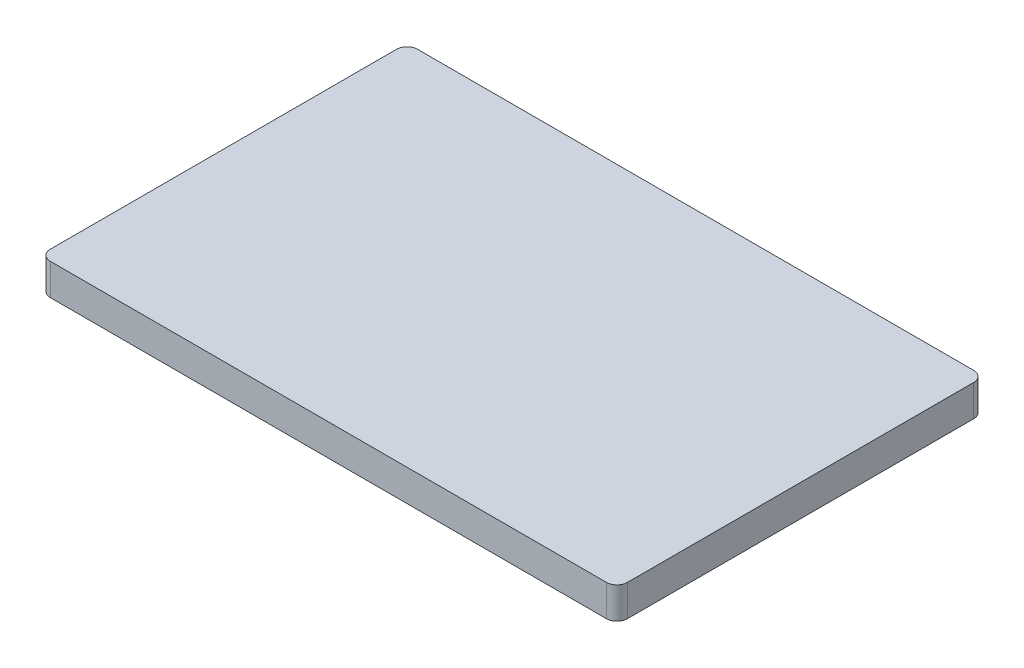
ISO-10303-21;
HEADER;
FILE_DESCRIPTION(('STEP AP214'),'2;1');
FILE_NAME('part.step','',(''),(''),'','','');
FILE_SCHEMA(('AUTOMOTIVE_DESIGN { 1 0 10303 214 1 1 1 1 }'));
ENDSEC;
DATA;
#1=APPLICATION_CONTEXT('core data for automotive mechanical design processes');
#2=APPLICATION_PROTOCOL_DEFINITION('international standard','automotive_design',2000,#1);
#3=PRODUCT_CONTEXT('',#1,'mechanical');
#4=PRODUCT('Part','Part','',(#3));
#5=PRODUCT_RELATED_PRODUCT_CATEGORY('part','',(#4));
#6=PRODUCT_DEFINITION_FORMATION('','',#4);
#7=PRODUCT_DEFINITION_CONTEXT('part definition',#1,'design');
#8=PRODUCT_DEFINITION('design','',#6,#7);
#9=PRODUCT_DEFINITION_SHAPE('','',#8);
#10=(LENGTH_UNIT() NAMED_UNIT(*) SI_UNIT(.MILLI.,.METRE.));
#11=(NAMED_UNIT(*) PLANE_ANGLE_UNIT() SI_UNIT($,.RADIAN.));
#12=(NAMED_UNIT(*) SI_UNIT($,.STERADIAN.) SOLID_ANGLE_UNIT());
#13=UNCERTAINTY_MEASURE_WITH_UNIT(LENGTH_MEASURE(1.E-05),#10,'distance_accuracy_value','');
#14=(GEOMETRIC_REPRESENTATION_CONTEXT(3) GLOBAL_UNCERTAINTY_ASSIGNED_CONTEXT((#13)) GLOBAL_UNIT_ASSIGNED_CONTEXT((#10,
#11,#12)) REPRESENTATION_CONTEXT('',''));
#15=CARTESIAN_POINT('',(0.,0.,0.));
#16=DIRECTION('',(0.,0.,1.));
#17=DIRECTION('',(1.,0.,0.));
#18=AXIS2_PLACEMENT_3D('',#15,#16,#17);
#19=CARTESIAN_POINT('',(26.5,3.,16.5));
#20=DIRECTION('',(0.,-1.,0.));
#21=DIRECTION('',(0.,0.,-1.));
#22=AXIS2_PLACEMENT_3D('',#19,#20,#21);
#23=CYLINDRICAL_SURFACE('',#22,1.);
#24=CARTESIAN_POINT('',(26.5,0.,16.5));
#25=DIRECTION('',(0.,1.,0.));
#26=DIRECTION('',(0.,0.,1.));
#27=AXIS2_PLACEMENT_3D('',#24,#25,#26);
#28=CIRCLE('',#27,1.);
#29=CARTESIAN_POINT('',(26.5,0.,17.5));
#30=VERTEX_POINT('',#29);
#31=CARTESIAN_POINT('',(27.5,0.,16.5));
#32=VERTEX_POINT('',#31);
#33=EDGE_CURVE('E130',#30,#32,#28,.T.);
#34=ORIENTED_EDGE('',*,*,#33,.T.);
#35=DIRECTION('',(0.,-1.,0.));
#36=VECTOR('',#35,1.);
#37=CARTESIAN_POINT('',(27.5,3.,16.5));
#38=LINE('',#37,#36);
#39=CARTESIAN_POINT('',(27.5,3.,16.5));
#40=VERTEX_POINT('',#39);
#41=EDGE_CURVE('E11',#40,#32,#38,.T.);
#42=ORIENTED_EDGE('',*,*,#41,.F.);
#43=CARTESIAN_POINT('',(26.5,3.,16.5));
#44=DIRECTION('',(0.,1.,0.));
#45=DIRECTION('',(0.,0.,1.));
#46=AXIS2_PLACEMENT_3D('',#43,#44,#45);
#47=CIRCLE('',#46,1.);
#48=CARTESIAN_POINT('',(26.5,3.,17.5));
#49=VERTEX_POINT('',#48);
#50=EDGE_CURVE('E144',#49,#40,#47,.T.);
#51=ORIENTED_EDGE('',*,*,#50,.F.);
#52=DIRECTION('',(0.,-1.,0.));
#53=VECTOR('',#52,1.);
#54=CARTESIAN_POINT('',(26.5,3.,17.5));
#55=LINE('',#54,#53);
#56=EDGE_CURVE('E126',#49,#30,#55,.T.);
#57=ORIENTED_EDGE('',*,*,#56,.T.);
#58=EDGE_LOOP('',(#34,#42,#51,#57));
#59=FACE_BOUND('',#58,.T.);
#60=ADVANCED_FACE('F34',(#59),#23,.T.);
#61=CARTESIAN_POINT('',(27.5,3.,16.5));
#62=DIRECTION('',(-1.,0.,0.));
#63=DIRECTION('',(0.,0.,1.));
#64=AXIS2_PLACEMENT_3D('',#61,#62,#63);
#65=PLANE('',#64);
#66=DIRECTION('',(0.,0.,-1.));
#67=VECTOR('',#66,1.);
#68=CARTESIAN_POINT('',(27.5,0.,16.5));
#69=LINE('',#68,#67);
#70=CARTESIAN_POINT('',(27.5,0.,-16.5));
#71=VERTEX_POINT('',#70);
#72=EDGE_CURVE('E133',#32,#71,#69,.T.);
#73=ORIENTED_EDGE('',*,*,#72,.T.);
#74=DIRECTION('',(0.,-1.,0.));
#75=VECTOR('',#74,1.);
#76=CARTESIAN_POINT('',(27.5,3.,-16.5));
#77=LINE('',#76,#75);
#78=CARTESIAN_POINT('',(27.5,3.,-16.5));
#79=VERTEX_POINT('',#78);
#80=EDGE_CURVE('E42',#79,#71,#77,.T.);
#81=ORIENTED_EDGE('',*,*,#80,.F.);
#82=DIRECTION('',(0.,0.,-1.));
#83=VECTOR('',#82,1.);
#84=CARTESIAN_POINT('',(27.5,3.,16.5));
#85=LINE('',#84,#83);
#86=EDGE_CURVE('E93',#40,#79,#85,.T.);
#87=ORIENTED_EDGE('',*,*,#86,.F.);
#88=ORIENTED_EDGE('',*,*,#41,.T.);
#89=EDGE_LOOP('',(#73,#81,#87,#88));
#90=FACE_BOUND('',#89,.T.);
#91=ADVANCED_FACE('F179',(#90),#65,.F.);
#92=CARTESIAN_POINT('',(26.5,3.,-16.5));
#93=DIRECTION('',(0.,-1.,0.));
#94=DIRECTION('',(0.,0.,-1.));
#95=AXIS2_PLACEMENT_3D('',#92,#93,#94);
#96=CYLINDRICAL_SURFACE('',#95,1.);
#97=CARTESIAN_POINT('',(26.5,0.,-16.5));
#98=DIRECTION('',(0.,1.,0.));
#99=DIRECTION('',(0.,0.,1.));
#100=AXIS2_PLACEMENT_3D('',#97,#98,#99);
#101=CIRCLE('',#100,1.);
#102=CARTESIAN_POINT('',(26.5,0.,-17.5));
#103=VERTEX_POINT('',#102);
#104=EDGE_CURVE('E135',#71,#103,#101,.T.);
#105=ORIENTED_EDGE('',*,*,#104,.T.);
#106=DIRECTION('',(0.,-1.,0.));
#107=VECTOR('',#106,1.);
#108=CARTESIAN_POINT('',(26.5,3.,-17.5));
#109=LINE('',#108,#107);
#110=CARTESIAN_POINT('',(26.5,3.,-17.5));
#111=VERTEX_POINT('',#110);
#112=EDGE_CURVE('E151',#111,#103,#109,.T.);
#113=ORIENTED_EDGE('',*,*,#112,.F.);
#114=CARTESIAN_POINT('',(26.5,3.,-16.5));
#115=DIRECTION('',(0.,1.,0.));
#116=DIRECTION('',(0.,0.,1.));
#117=AXIS2_PLACEMENT_3D('',#114,#115,#116);
#118=CIRCLE('',#117,1.);
#119=EDGE_CURVE('E159',#79,#111,#118,.T.);
#120=ORIENTED_EDGE('',*,*,#119,.F.);
#121=ORIENTED_EDGE('',*,*,#80,.T.);
#122=EDGE_LOOP('',(#105,#113,#120,#121));
#123=FACE_BOUND('',#122,.T.);
#124=ADVANCED_FACE('F157',(#123),#96,.T.);
#125=CARTESIAN_POINT('',(26.5,3.,-17.5));
#126=DIRECTION('',(0.,0.,1.));
#127=DIRECTION('',(1.,0.,0.));
#128=AXIS2_PLACEMENT_3D('',#125,#126,#127);
#129=PLANE('',#128);
#130=DIRECTION('',(-1.,0.,0.));
#131=VECTOR('',#130,1.);
#132=CARTESIAN_POINT('',(26.5,0.,-17.5));
#133=LINE('',#132,#131);
#134=CARTESIAN_POINT('',(-26.5,0.,-17.5));
#135=VERTEX_POINT('',#134);
#136=EDGE_CURVE('E137',#103,#135,#133,.T.);
#137=ORIENTED_EDGE('',*,*,#136,.T.);
#138=DIRECTION('',(0.,-1.,0.));
#139=VECTOR('',#138,1.);
#140=CARTESIAN_POINT('',(-26.5,3.,-17.5));
#141=LINE('',#140,#139);
#142=CARTESIAN_POINT('',(-26.5,3.,-17.5));
#143=VERTEX_POINT('',#142);
#144=EDGE_CURVE('E148',#143,#135,#141,.T.);
#145=ORIENTED_EDGE('',*,*,#144,.F.);
#146=DIRECTION('',(-1.,0.,0.));
#147=VECTOR('',#146,1.);
#148=CARTESIAN_POINT('',(26.5,3.,-17.5));
#149=LINE('',#148,#147);
#150=EDGE_CURVE('E171',#111,#143,#149,.T.);
#151=ORIENTED_EDGE('',*,*,#150,.F.);
#152=ORIENTED_EDGE('',*,*,#112,.T.);
#153=EDGE_LOOP('',(#137,#145,#151,#152));
#154=FACE_BOUND('',#153,.T.);
#155=ADVANCED_FACE('F167',(#154),#129,.F.);
#156=CARTESIAN_POINT('',(-26.5,3.,-16.5));
#157=DIRECTION('',(0.,-1.,0.));
#158=DIRECTION('',(0.,0.,-1.));
#159=AXIS2_PLACEMENT_3D('',#156,#157,#158);
#160=CYLINDRICAL_SURFACE('',#159,1.);
#161=CARTESIAN_POINT('',(-26.5,0.,-16.5));
#162=DIRECTION('',(0.,1.,0.));
#163=DIRECTION('',(0.,0.,1.));
#164=AXIS2_PLACEMENT_3D('',#161,#162,#163);
#165=CIRCLE('',#164,1.);
#166=CARTESIAN_POINT('',(-27.5,0.,-16.5));
#167=VERTEX_POINT('',#166);
#168=EDGE_CURVE('E139',#135,#167,#165,.T.);
#169=ORIENTED_EDGE('',*,*,#168,.T.);
#170=DIRECTION('',(0.,-1.,0.));
#171=VECTOR('',#170,1.);
#172=CARTESIAN_POINT('',(-27.5,3.,-16.5));
#173=LINE('',#172,#171);
#174=CARTESIAN_POINT('',(-27.5,3.,-16.5));
#175=VERTEX_POINT('',#174);
#176=EDGE_CURVE('E121',#175,#167,#173,.T.);
#177=ORIENTED_EDGE('',*,*,#176,.F.);
#178=CARTESIAN_POINT('',(-26.5,3.,-16.5));
#179=DIRECTION('',(0.,1.,0.));
#180=DIRECTION('',(0.,0.,1.));
#181=AXIS2_PLACEMENT_3D('',#178,#179,#180);
#182=CIRCLE('',#181,1.);
#183=EDGE_CURVE('E112',#143,#175,#182,.T.);
#184=ORIENTED_EDGE('',*,*,#183,.F.);
#185=ORIENTED_EDGE('',*,*,#144,.T.);
#186=EDGE_LOOP('',(#169,#177,#184,#185));
#187=FACE_BOUND('',#186,.T.);
#188=ADVANCED_FACE('F170',(#187),#160,.T.);
#189=CARTESIAN_POINT('',(-27.5,3.,16.5));
#190=DIRECTION('',(1.,0.,0.));
#191=DIRECTION('',(0.,0.,-1.));
#192=AXIS2_PLACEMENT_3D('',#189,#190,#191);
#193=PLANE('',#192);
#194=DIRECTION('',(0.,0.,1.));
#195=VECTOR('',#194,1.);
#196=CARTESIAN_POINT('',(-27.5,0.,16.5));
#197=LINE('',#196,#195);
#198=CARTESIAN_POINT('',(-27.5,0.,16.5));
#199=VERTEX_POINT('',#198);
#200=EDGE_CURVE('E120',#167,#199,#197,.T.);
#201=ORIENTED_EDGE('',*,*,#200,.T.);
#202=DIRECTION('',(0.,-1.,0.));
#203=VECTOR('',#202,1.);
#204=CARTESIAN_POINT('',(-27.5,3.,16.5));
#205=LINE('',#204,#203);
#206=CARTESIAN_POINT('',(-27.5,3.,16.5));
#207=VERTEX_POINT('',#206);
#208=EDGE_CURVE('E117',#207,#199,#205,.T.);
#209=ORIENTED_EDGE('',*,*,#208,.F.);
#210=DIRECTION('',(0.,0.,1.));
#211=VECTOR('',#210,1.);
#212=CARTESIAN_POINT('',(-27.5,3.,16.5));
#213=LINE('',#212,#211);
#214=EDGE_CURVE('E106',#175,#207,#213,.T.);
#215=ORIENTED_EDGE('',*,*,#214,.F.);
#216=ORIENTED_EDGE('',*,*,#176,.T.);
#217=EDGE_LOOP('',(#201,#209,#215,#216));
#218=FACE_BOUND('',#217,.T.);
#219=ADVANCED_FACE('F118',(#218),#193,.F.);
#220=CARTESIAN_POINT('',(-26.5,3.,16.5));
#221=DIRECTION('',(0.,-1.,0.));
#222=DIRECTION('',(0.,0.,-1.));
#223=AXIS2_PLACEMENT_3D('',#220,#221,#222);
#224=CYLINDRICAL_SURFACE('',#223,1.);
#225=CARTESIAN_POINT('',(-26.5,0.,16.5));
#226=DIRECTION('',(0.,1.,0.));
#227=DIRECTION('',(0.,0.,-1.));
#228=AXIS2_PLACEMENT_3D('',#225,#226,#227);
#229=CIRCLE('',#228,1.);
#230=CARTESIAN_POINT('',(-26.5,0.,17.5));
#231=VERTEX_POINT('',#230);
#232=EDGE_CURVE('E79',#199,#231,#229,.T.);
#233=ORIENTED_EDGE('',*,*,#232,.T.);
#234=DIRECTION('',(0.,-1.,0.));
#235=VECTOR('',#234,1.);
#236=CARTESIAN_POINT('',(-26.5,3.,17.5));
#237=LINE('',#236,#235);
#238=CARTESIAN_POINT('',(-26.5,3.,17.5));
#239=VERTEX_POINT('',#238);
#240=EDGE_CURVE('E122',#239,#231,#237,.T.);
#241=ORIENTED_EDGE('',*,*,#240,.F.);
#242=CARTESIAN_POINT('',(-26.5,3.,16.5));
#243=DIRECTION('',(0.,1.,0.));
#244=DIRECTION('',(0.,0.,-1.));
#245=AXIS2_PLACEMENT_3D('',#242,#243,#244);
#246=CIRCLE('',#245,1.);
#247=EDGE_CURVE('E110',#207,#239,#246,.T.);
#248=ORIENTED_EDGE('',*,*,#247,.F.);
#249=ORIENTED_EDGE('',*,*,#208,.T.);
#250=EDGE_LOOP('',(#233,#241,#248,#249));
#251=FACE_BOUND('',#250,.T.);
#252=ADVANCED_FACE('F124',(#251),#224,.T.);
#253=CARTESIAN_POINT('',(26.5,3.,17.5));
#254=DIRECTION('',(0.,0.,-1.));
#255=DIRECTION('',(-1.,0.,0.));
#256=AXIS2_PLACEMENT_3D('',#253,#254,#255);
#257=PLANE('',#256);
#258=DIRECTION('',(1.,0.,0.));
#259=VECTOR('',#258,1.);
#260=CARTESIAN_POINT('',(26.5,0.,17.5));
#261=LINE('',#260,#259);
#262=EDGE_CURVE('E85',#231,#30,#261,.T.);
#263=ORIENTED_EDGE('',*,*,#262,.T.);
#264=ORIENTED_EDGE('',*,*,#56,.F.);
#265=DIRECTION('',(1.,0.,0.));
#266=VECTOR('',#265,1.);
#267=CARTESIAN_POINT('',(26.5,3.,17.5));
#268=LINE('',#267,#266);
#269=EDGE_CURVE('E50',#239,#49,#268,.T.);
#270=ORIENTED_EDGE('',*,*,#269,.F.);
#271=ORIENTED_EDGE('',*,*,#240,.T.);
#272=EDGE_LOOP('',(#263,#264,#270,#271));
#273=FACE_BOUND('',#272,.T.);
#274=ADVANCED_FACE('F195',(#273),#257,.F.);
#275=CARTESIAN_POINT('',(26.5,3.,16.5));
#276=DIRECTION('',(0.,1.,0.));
#277=DIRECTION('',(0.,0.,1.));
#278=AXIS2_PLACEMENT_3D('',#275,#276,#277);
#279=PLANE('',#278);
#280=ORIENTED_EDGE('',*,*,#50,.T.);
#281=ORIENTED_EDGE('',*,*,#86,.T.);
#282=ORIENTED_EDGE('',*,*,#119,.T.);
#283=ORIENTED_EDGE('',*,*,#150,.T.);
#284=ORIENTED_EDGE('',*,*,#183,.T.);
#285=ORIENTED_EDGE('',*,*,#214,.T.);
#286=ORIENTED_EDGE('',*,*,#247,.T.);
#287=ORIENTED_EDGE('',*,*,#269,.T.);
#288=EDGE_LOOP('',(#280,#281,#282,#283,#284,#285,#286,#287));
#289=FACE_BOUND('',#288,.T.);
#290=ADVANCED_FACE('F108',(#289),#279,.T.);
#291=CARTESIAN_POINT('',(26.5,0.,16.5));
#292=DIRECTION('',(0.,1.,0.));
#293=DIRECTION('',(0.,0.,1.));
#294=AXIS2_PLACEMENT_3D('',#291,#292,#293);
#295=PLANE('',#294);
#296=ORIENTED_EDGE('',*,*,#33,.F.);
#297=ORIENTED_EDGE('',*,*,#262,.F.);
#298=ORIENTED_EDGE('',*,*,#232,.F.);
#299=ORIENTED_EDGE('',*,*,#200,.F.);
#300=ORIENTED_EDGE('',*,*,#168,.F.);
#301=ORIENTED_EDGE('',*,*,#136,.F.);
#302=ORIENTED_EDGE('',*,*,#104,.F.);
#303=ORIENTED_EDGE('',*,*,#72,.F.);
#304=EDGE_LOOP('',(#296,#297,#298,#299,#300,#301,#302,#303));
#305=FACE_BOUND('',#304,.T.);
#306=ADVANCED_FACE('F163',(#305),#295,.F.);
#307=CLOSED_SHELL('',(#60,#91,#124,#155,#188,#219,#252,#274,#290,#306));
#308=MANIFOLD_SOLID_BREP('B2',#307);
#309=ADVANCED_BREP_SHAPE_REPRESENTATION('',(#18,#308),#14);
#310=SHAPE_DEFINITION_REPRESENTATION(#9,#309);
ENDSEC;
END-ISO-10303-21;
